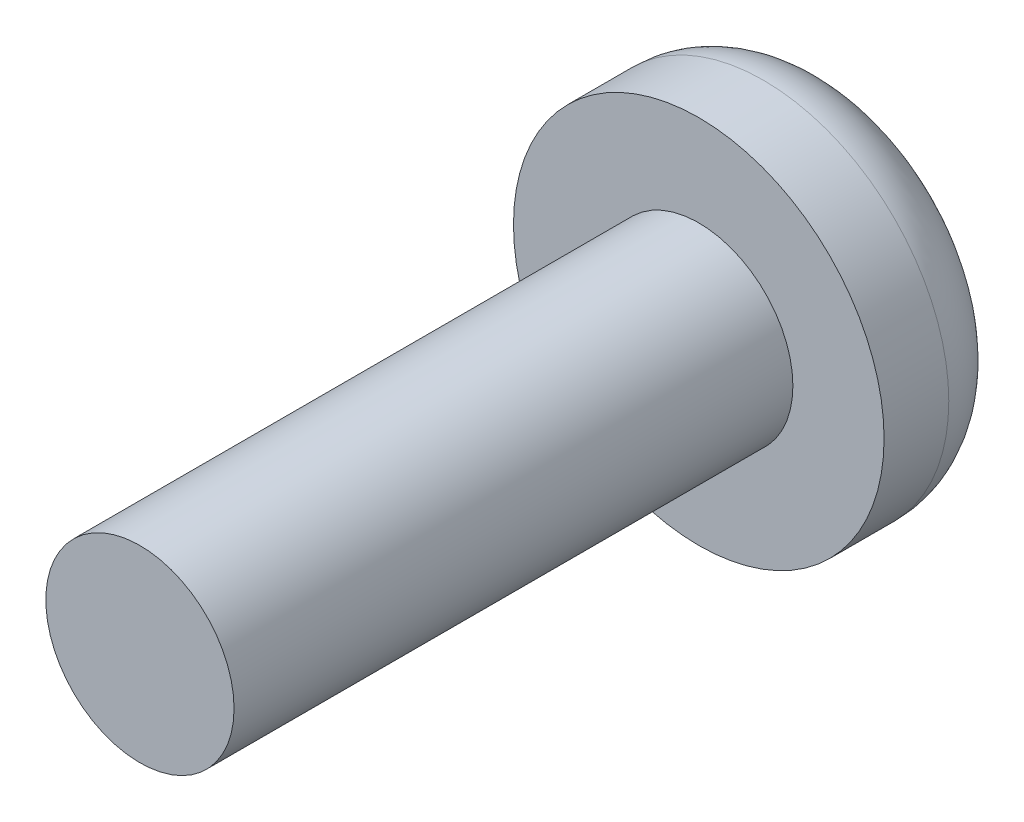
ISO-10303-21;
HEADER;
FILE_DESCRIPTION(('STEP AP214'),'2;1');
FILE_NAME('part.step','',(''),(''),'','','');
FILE_SCHEMA(('AUTOMOTIVE_DESIGN { 1 0 10303 214 1 1 1 1 }'));
ENDSEC;
DATA;
#1=APPLICATION_CONTEXT('core data for automotive mechanical design processes');
#2=APPLICATION_PROTOCOL_DEFINITION('international standard','automotive_design',2000,#1);
#3=PRODUCT_CONTEXT('',#1,'mechanical');
#4=PRODUCT('Part','Part','',(#3));
#5=PRODUCT_RELATED_PRODUCT_CATEGORY('part','',(#4));
#6=PRODUCT_DEFINITION_FORMATION('','',#4);
#7=PRODUCT_DEFINITION_CONTEXT('part definition',#1,'design');
#8=PRODUCT_DEFINITION('design','',#6,#7);
#9=PRODUCT_DEFINITION_SHAPE('','',#8);
#10=(LENGTH_UNIT() NAMED_UNIT(*) SI_UNIT(.MILLI.,.METRE.));
#11=(NAMED_UNIT(*) PLANE_ANGLE_UNIT() SI_UNIT($,.RADIAN.));
#12=(NAMED_UNIT(*) SI_UNIT($,.STERADIAN.) SOLID_ANGLE_UNIT());
#13=UNCERTAINTY_MEASURE_WITH_UNIT(LENGTH_MEASURE(1.E-05),#10,'distance_accuracy_value','');
#14=(GEOMETRIC_REPRESENTATION_CONTEXT(3) GLOBAL_UNCERTAINTY_ASSIGNED_CONTEXT((#13)) GLOBAL_UNIT_ASSIGNED_CONTEXT((#10,
#11,#12)) REPRESENTATION_CONTEXT('',''));
#15=CARTESIAN_POINT('',(0.,0.,0.));
#16=DIRECTION('',(0.,0.,1.));
#17=DIRECTION('',(1.,0.,0.));
#18=AXIS2_PLACEMENT_3D('',#15,#16,#17);
#19=CARTESIAN_POINT('',(0.,0.,0.));
#20=DIRECTION('',(0.,0.,1.));
#21=DIRECTION('',(1.,0.,0.));
#22=AXIS2_PLACEMENT_3D('',#19,#20,#21);
#23=PLANE('',#22);
#24=DIRECTION('',(1.,0.,0.));
#25=VECTOR('',#24,1.);
#26=CARTESIAN_POINT('',(-2.457284940462,0.307900911623638,0.));
#27=LINE('',#26,#25);
#28=CARTESIAN_POINT('',(0.307900911623639,0.307900911623638,0.));
#29=VERTEX_POINT('',#28);
#30=CARTESIAN_POINT('',(2.457284940462,0.307900911623638,0.));
#31=VERTEX_POINT('',#30);
#32=EDGE_CURVE('E202',#29,#31,#27,.T.);
#33=ORIENTED_EDGE('',*,*,#32,.F.);
#34=DIRECTION('',(0.,-1.,0.));
#35=VECTOR('',#34,1.);
#36=CARTESIAN_POINT('',(0.307900911623646,2.457284940462,0.));
#37=LINE('',#36,#35);
#38=CARTESIAN_POINT('',(0.307900911623646,2.457284940462,0.));
#39=VERTEX_POINT('',#38);
#40=EDGE_CURVE('E149',#39,#29,#37,.T.);
#41=ORIENTED_EDGE('',*,*,#40,.F.);
#42=CARTESIAN_POINT('',(0.,0.,0.));
#43=DIRECTION('',(0.,0.,1.));
#44=DIRECTION('',(1.,0.,0.));
#45=AXIS2_PLACEMENT_3D('',#42,#43,#44);
#46=CIRCLE('',#45,2.4765);
#47=EDGE_CURVE('E44',#39,#31,#46,.F.);
#48=ORIENTED_EDGE('',*,*,#47,.T.);
#49=EDGE_LOOP('',(#33,#41,#48));
#50=FACE_BOUND('',#49,.T.);
#51=ADVANCED_FACE('F35',(#50),#23,.F.);
#52=CARTESIAN_POINT('',(-0.307900911623629,2.457284940462,0.));
#53=VERTEX_POINT('',#52);
#54=EDGE_CURVE('E234',#53,#39,#46,.F.);
#55=ORIENTED_EDGE('',*,*,#54,.T.);
#56=DIRECTION('',(1.,0.,0.));
#57=VECTOR('',#56,1.);
#58=CARTESIAN_POINT('',(0.307900911623646,2.457284940462,0.));
#59=LINE('',#58,#57);
#60=EDGE_CURVE('E160',#53,#39,#59,.T.);
#61=ORIENTED_EDGE('',*,*,#60,.F.);
#62=EDGE_LOOP('',(#55,#61));
#63=FACE_BOUND('',#62,.T.);
#64=ADVANCED_FACE('F249',(#63),#23,.F.);
#65=CARTESIAN_POINT('',(2.457284940462,-0.307900911623636,0.));
#66=VERTEX_POINT('',#65);
#67=CARTESIAN_POINT('',(0.307900911623629,-2.457284940462,0.));
#68=VERTEX_POINT('',#67);
#69=EDGE_CURVE('E11',#66,#68,#46,.F.);
#70=ORIENTED_EDGE('',*,*,#69,.T.);
#71=CARTESIAN_POINT('',(0.307900911623636,-0.307900911623638,0.));
#72=VERTEX_POINT('',#71);
#73=EDGE_CURVE('E151',#72,#68,#37,.T.);
#74=ORIENTED_EDGE('',*,*,#73,.F.);
#75=DIRECTION('',(-1.,0.,0.));
#76=VECTOR('',#75,1.);
#77=CARTESIAN_POINT('',(-2.457284940462,-0.307900911623638,0.));
#78=LINE('',#77,#76);
#79=EDGE_CURVE('E196',#66,#72,#78,.T.);
#80=ORIENTED_EDGE('',*,*,#79,.F.);
#81=EDGE_LOOP('',(#70,#74,#80));
#82=FACE_BOUND('',#81,.T.);
#83=ADVANCED_FACE('F272',(#82),#23,.F.);
#84=CARTESIAN_POINT('',(-0.307900911623646,-2.457284940462,0.));
#85=VERTEX_POINT('',#84);
#86=EDGE_CURVE('E43',#68,#85,#46,.F.);
#87=ORIENTED_EDGE('',*,*,#86,.T.);
#88=DIRECTION('',(-1.,0.,0.));
#89=VECTOR('',#88,1.);
#90=CARTESIAN_POINT('',(0.307900911623629,-2.457284940462,0.));
#91=LINE('',#90,#89);
#92=EDGE_CURVE('E132',#68,#85,#91,.T.);
#93=ORIENTED_EDGE('',*,*,#92,.F.);
#94=EDGE_LOOP('',(#87,#93));
#95=FACE_BOUND('',#94,.T.);
#96=ADVANCED_FACE('F283',(#95),#23,.F.);
#97=CARTESIAN_POINT('',(-2.457284940462,0.307900911623638,1.016));
#98=DIRECTION('',(0.,1.,0.));
#99=DIRECTION('',(0.,0.,1.));
#100=AXIS2_PLACEMENT_3D('',#97,#98,#99);
#101=PLANE('',#100);
#102=DIRECTION('',(1.,0.,0.));
#103=VECTOR('',#102,1.);
#104=CARTESIAN_POINT('',(-2.457284940462,0.307900911623638,1.016));
#105=LINE('',#104,#103);
#106=CARTESIAN_POINT('',(0.307900911623638,0.307900911623638,1.016));
#107=VERTEX_POINT('',#106);
#108=CARTESIAN_POINT('',(2.457284940462,0.307900911623638,1.016));
#109=VERTEX_POINT('',#108);
#110=EDGE_CURVE('E190',#107,#109,#105,.T.);
#111=ORIENTED_EDGE('',*,*,#110,.F.);
#112=DIRECTION('',(0.,0.,-1.));
#113=VECTOR('',#112,1.);
#114=CARTESIAN_POINT('',(0.307900911623639,0.307900911623638,1.016));
#115=LINE('',#114,#113);
#116=EDGE_CURVE('E176',#107,#29,#115,.T.);
#117=ORIENTED_EDGE('',*,*,#116,.T.);
#118=ORIENTED_EDGE('',*,*,#32,.T.);
#119=DIRECTION('',(0.,0.,-1.));
#120=VECTOR('',#119,1.);
#121=CARTESIAN_POINT('',(2.457284940462,0.307900911623638,1.016));
#122=LINE('',#121,#120);
#123=EDGE_CURVE('E205',#109,#31,#122,.T.);
#124=ORIENTED_EDGE('',*,*,#123,.F.);
#125=EDGE_LOOP('',(#111,#117,#118,#124));
#126=FACE_BOUND('',#125,.T.);
#127=ADVANCED_FACE('F288',(#126),#101,.F.);
#128=CARTESIAN_POINT('',(-2.457284940462,-0.307900911623638,1.016));
#129=DIRECTION('',(0.,-1.,0.));
#130=DIRECTION('',(0.,0.,-1.));
#131=AXIS2_PLACEMENT_3D('',#128,#129,#130);
#132=PLANE('',#131);
#133=ORIENTED_EDGE('',*,*,#79,.T.);
#134=DIRECTION('',(0.,0.,1.));
#135=VECTOR('',#134,1.);
#136=CARTESIAN_POINT('',(0.307900911623637,-0.307900911623638,1.016));
#137=LINE('',#136,#135);
#138=CARTESIAN_POINT('',(0.307900911623636,-0.307900911623638,1.016));
#139=VERTEX_POINT('',#138);
#140=EDGE_CURVE('E173',#72,#139,#137,.T.);
#141=ORIENTED_EDGE('',*,*,#140,.T.);
#142=DIRECTION('',(-1.,0.,0.));
#143=VECTOR('',#142,1.);
#144=CARTESIAN_POINT('',(-2.457284940462,-0.307900911623638,1.016));
#145=LINE('',#144,#143);
#146=CARTESIAN_POINT('',(2.457284940462,-0.307900911623638,1.016));
#147=VERTEX_POINT('',#146);
#148=EDGE_CURVE('E185',#147,#139,#145,.T.);
#149=ORIENTED_EDGE('',*,*,#148,.F.);
#150=DIRECTION('',(0.,0.,-1.));
#151=VECTOR('',#150,1.);
#152=CARTESIAN_POINT('',(2.457284940462,-0.307900911623638,1.016));
#153=LINE('',#152,#151);
#154=EDGE_CURVE('E193',#147,#66,#153,.T.);
#155=ORIENTED_EDGE('',*,*,#154,.T.);
#156=EDGE_LOOP('',(#133,#141,#149,#155));
#157=FACE_BOUND('',#156,.T.);
#158=ADVANCED_FACE('F274',(#157),#132,.F.);
#159=EDGE_CURVE('E225',#31,#66,#46,.F.);
#160=ORIENTED_EDGE('',*,*,#159,.T.);
#161=DIRECTION('',(0.,-1.,0.));
#162=VECTOR('',#161,1.);
#163=CARTESIAN_POINT('',(2.457284940462,0.307900911623638,0.));
#164=LINE('',#163,#162);
#165=EDGE_CURVE('E179',#31,#66,#164,.T.);
#166=ORIENTED_EDGE('',*,*,#165,.F.);
#167=EDGE_LOOP('',(#160,#166));
#168=FACE_BOUND('',#167,.T.);
#169=ADVANCED_FACE('F280',(#168),#23,.F.);
#170=CARTESIAN_POINT('',(-2.457284940462,0.307900911623638,0.));
#171=VERTEX_POINT('',#170);
#172=EDGE_CURVE('E229',#171,#53,#46,.F.);
#173=ORIENTED_EDGE('',*,*,#172,.T.);
#174=DIRECTION('',(0.,1.,0.));
#175=VECTOR('',#174,1.);
#176=CARTESIAN_POINT('',(-0.307900911623629,2.457284940462,0.));
#177=LINE('',#176,#175);
#178=CARTESIAN_POINT('',(-0.307900911623636,0.307900911623638,0.));
#179=VERTEX_POINT('',#178);
#180=EDGE_CURVE('E157',#179,#53,#177,.T.);
#181=ORIENTED_EDGE('',*,*,#180,.F.);
#182=EDGE_CURVE('E184',#171,#179,#27,.T.);
#183=ORIENTED_EDGE('',*,*,#182,.F.);
#184=EDGE_LOOP('',(#173,#181,#183));
#185=FACE_BOUND('',#184,.T.);
#186=ADVANCED_FACE('F258',(#185),#23,.F.);
#187=CARTESIAN_POINT('',(-2.457284940462,-0.307900911623638,0.));
#188=VERTEX_POINT('',#187);
#189=EDGE_CURVE('E45',#188,#171,#46,.F.);
#190=ORIENTED_EDGE('',*,*,#189,.T.);
#191=DIRECTION('',(0.,1.,0.));
#192=VECTOR('',#191,1.);
#193=CARTESIAN_POINT('',(-2.457284940462,0.307900911623638,0.));
#194=LINE('',#193,#192);
#195=EDGE_CURVE('E199',#188,#171,#194,.T.);
#196=ORIENTED_EDGE('',*,*,#195,.F.);
#197=EDGE_LOOP('',(#190,#196));
#198=FACE_BOUND('',#197,.T.);
#199=ADVANCED_FACE('F268',(#198),#23,.F.);
#200=CARTESIAN_POINT('',(0.,0.,2.921));
#201=DIRECTION('',(0.,0.,1.));
#202=DIRECTION('',(1.,0.,0.));
#203=AXIS2_PLACEMENT_3D('',#200,#201,#202);
#204=PLANE('',#203);
#205=CARTESIAN_POINT('',(0.,0.,2.921));
#206=DIRECTION('',(0.,0.,1.));
#207=DIRECTION('',(1.,0.,0.));
#208=AXIS2_PLACEMENT_3D('',#205,#206,#207);
#209=CIRCLE('',#208,4.0005);
#210=CARTESIAN_POINT('',(4.0005,0.,2.921));
#211=VERTEX_POINT('',#210);
#212=EDGE_CURVE('E219',#211,#211,#209,.T.);
#213=ORIENTED_EDGE('',*,*,#212,.T.);
#214=EDGE_LOOP('',(#213));
#215=FACE_BOUND('',#214,.T.);
#216=CARTESIAN_POINT('',(0.,0.,2.921));
#217=DIRECTION('',(0.,0.,1.));
#218=DIRECTION('',(1.,0.,0.));
#219=AXIS2_PLACEMENT_3D('',#216,#217,#218);
#220=CIRCLE('',#219,2.032);
#221=CARTESIAN_POINT('',(2.032,0.,2.921));
#222=VERTEX_POINT('',#221);
#223=EDGE_CURVE('E208',#222,#222,#220,.T.);
#224=ORIENTED_EDGE('',*,*,#223,.F.);
#225=EDGE_LOOP('',(#224));
#226=FACE_BOUND('',#225,.T.);
#227=ADVANCED_FACE('F307',(#215,#226),#204,.T.);
#228=CARTESIAN_POINT('',(0.,0.,2.921));
#229=DIRECTION('',(0.,0.,-1.));
#230=DIRECTION('',(-1.,0.,0.));
#231=AXIS2_PLACEMENT_3D('',#228,#229,#230);
#232=CYLINDRICAL_SURFACE('',#231,4.0005);
#233=CARTESIAN_POINT('',(0.,0.,1.524));
#234=DIRECTION('',(0.,0.,1.));
#235=DIRECTION('',(1.,0.,0.));
#236=AXIS2_PLACEMENT_3D('',#233,#234,#235);
#237=CIRCLE('',#236,4.0005);
#238=CARTESIAN_POINT('',(4.0005,0.,1.524));
#239=VERTEX_POINT('',#238);
#240=EDGE_CURVE('E223',#239,#239,#237,.T.);
#241=ORIENTED_EDGE('',*,*,#240,.T.);
#242=EDGE_LOOP('',(#241));
#243=FACE_BOUND('',#242,.T.);
#244=ORIENTED_EDGE('',*,*,#212,.F.);
#245=EDGE_LOOP('',(#244));
#246=FACE_BOUND('',#245,.T.);
#247=ADVANCED_FACE('F301',(#243,#246),#232,.T.);
#248=CARTESIAN_POINT('',(-0.307900911623639,-0.307900911623638,0.));
#249=VERTEX_POINT('',#248);
#250=EDGE_CURVE('E195',#249,#188,#78,.T.);
#251=ORIENTED_EDGE('',*,*,#250,.F.);
#252=EDGE_CURVE('E158',#85,#249,#177,.T.);
#253=ORIENTED_EDGE('',*,*,#252,.F.);
#254=EDGE_CURVE('E237',#85,#188,#46,.F.);
#255=ORIENTED_EDGE('',*,*,#254,.T.);
#256=EDGE_LOOP('',(#251,#253,#255));
#257=FACE_BOUND('',#256,.T.);
#258=ADVANCED_FACE('F291',(#257),#23,.F.);
#259=CARTESIAN_POINT('',(0.,0.,1.524));
#260=DIRECTION('',(0.,0.,1.));
#261=DIRECTION('',(1.,0.,0.));
#262=AXIS2_PLACEMENT_3D('',#259,#260,#261);
#263=TOROIDAL_SURFACE('',#262,2.4765,1.524);
#264=ORIENTED_EDGE('',*,*,#69,.F.);
#265=ORIENTED_EDGE('',*,*,#159,.F.);
#266=ORIENTED_EDGE('',*,*,#47,.F.);
#267=ORIENTED_EDGE('',*,*,#54,.F.);
#268=ORIENTED_EDGE('',*,*,#172,.F.);
#269=ORIENTED_EDGE('',*,*,#189,.F.);
#270=ORIENTED_EDGE('',*,*,#254,.F.);
#271=ORIENTED_EDGE('',*,*,#86,.F.);
#272=EDGE_LOOP('',(#264,#265,#266,#267,#268,#269,#270,#271));
#273=FACE_BOUND('',#272,.T.);
#274=ORIENTED_EDGE('',*,*,#240,.F.);
#275=EDGE_LOOP('',(#274));
#276=FACE_BOUND('',#275,.T.);
#277=ADVANCED_FACE('F37',(#273,#276),#263,.T.);
#278=CARTESIAN_POINT('',(0.,0.,14.986));
#279=DIRECTION('',(0.,0.,-1.));
#280=DIRECTION('',(-1.,0.,0.));
#281=AXIS2_PLACEMENT_3D('',#278,#279,#280);
#282=CYLINDRICAL_SURFACE('',#281,2.032);
#283=CARTESIAN_POINT('',(0.,0.,14.986));
#284=DIRECTION('',(0.,0.,1.));
#285=DIRECTION('',(1.,0.,0.));
#286=AXIS2_PLACEMENT_3D('',#283,#284,#285);
#287=CIRCLE('',#286,2.032);
#288=CARTESIAN_POINT('',(2.032,0.,14.986));
#289=VERTEX_POINT('',#288);
#290=EDGE_CURVE('E216',#289,#289,#287,.T.);
#291=ORIENTED_EDGE('',*,*,#290,.F.);
#292=EDGE_LOOP('',(#291));
#293=FACE_BOUND('',#292,.T.);
#294=ORIENTED_EDGE('',*,*,#223,.T.);
#295=EDGE_LOOP('',(#294));
#296=FACE_BOUND('',#295,.T.);
#297=ADVANCED_FACE('F306',(#293,#296),#282,.T.);
#298=CARTESIAN_POINT('',(0.,0.,14.986));
#299=DIRECTION('',(0.,0.,1.));
#300=DIRECTION('',(1.,0.,0.));
#301=AXIS2_PLACEMENT_3D('',#298,#299,#300);
#302=PLANE('',#301);
#303=ORIENTED_EDGE('',*,*,#290,.T.);
#304=EDGE_LOOP('',(#303));
#305=FACE_BOUND('',#304,.T.);
#306=ADVANCED_FACE('F319',(#305),#302,.T.);
#307=CARTESIAN_POINT('',(2.457284940462,0.307900911623638,1.016));
#308=DIRECTION('',(1.,0.,0.));
#309=DIRECTION('',(0.,0.,-1.));
#310=AXIS2_PLACEMENT_3D('',#307,#308,#309);
#311=PLANE('',#310);
#312=ORIENTED_EDGE('',*,*,#165,.T.);
#313=ORIENTED_EDGE('',*,*,#154,.F.);
#314=DIRECTION('',(0.,-1.,0.));
#315=VECTOR('',#314,1.);
#316=CARTESIAN_POINT('',(2.457284940462,0.307900911623638,1.016));
#317=LINE('',#316,#315);
#318=EDGE_CURVE('E180',#109,#147,#317,.T.);
#319=ORIENTED_EDGE('',*,*,#318,.F.);
#320=ORIENTED_EDGE('',*,*,#123,.T.);
#321=EDGE_LOOP('',(#312,#313,#319,#320));
#322=FACE_BOUND('',#321,.T.);
#323=ADVANCED_FACE('F278',(#322),#311,.F.);
#324=ORIENTED_EDGE('',*,*,#182,.T.);
#325=DIRECTION('',(0.,0.,1.));
#326=VECTOR('',#325,1.);
#327=CARTESIAN_POINT('',(-0.307900911623636,0.307900911623638,1.016));
#328=LINE('',#327,#326);
#329=CARTESIAN_POINT('',(-0.307900911623636,0.307900911623638,1.016));
#330=VERTEX_POINT('',#329);
#331=EDGE_CURVE('E170',#179,#330,#328,.T.);
#332=ORIENTED_EDGE('',*,*,#331,.T.);
#333=CARTESIAN_POINT('',(-2.457284940462,0.307900911623638,1.016));
#334=VERTEX_POINT('',#333);
#335=EDGE_CURVE('E191',#334,#330,#105,.T.);
#336=ORIENTED_EDGE('',*,*,#335,.F.);
#337=DIRECTION('',(0.,0.,-1.));
#338=VECTOR('',#337,1.);
#339=CARTESIAN_POINT('',(-2.457284940462,0.307900911623638,1.016));
#340=LINE('',#339,#338);
#341=EDGE_CURVE('E209',#334,#171,#340,.T.);
#342=ORIENTED_EDGE('',*,*,#341,.T.);
#343=EDGE_LOOP('',(#324,#332,#336,#342));
#344=FACE_BOUND('',#343,.T.);
#345=ADVANCED_FACE('F260',(#344),#101,.F.);
#346=CARTESIAN_POINT('',(-2.457284940462,0.307900911623638,1.016));
#347=DIRECTION('',(-1.,0.,0.));
#348=DIRECTION('',(0.,0.,1.));
#349=AXIS2_PLACEMENT_3D('',#346,#347,#348);
#350=PLANE('',#349);
#351=ORIENTED_EDGE('',*,*,#195,.T.);
#352=ORIENTED_EDGE('',*,*,#341,.F.);
#353=DIRECTION('',(0.,1.,0.));
#354=VECTOR('',#353,1.);
#355=CARTESIAN_POINT('',(-2.457284940462,0.307900911623638,1.016));
#356=LINE('',#355,#354);
#357=CARTESIAN_POINT('',(-2.457284940462,-0.307900911623638,1.016));
#358=VERTEX_POINT('',#357);
#359=EDGE_CURVE('E187',#358,#334,#356,.T.);
#360=ORIENTED_EDGE('',*,*,#359,.F.);
#361=DIRECTION('',(0.,0.,-1.));
#362=VECTOR('',#361,1.);
#363=CARTESIAN_POINT('',(-2.457284940462,-0.307900911623638,1.016));
#364=LINE('',#363,#362);
#365=EDGE_CURVE('E211',#358,#188,#364,.T.);
#366=ORIENTED_EDGE('',*,*,#365,.T.);
#367=EDGE_LOOP('',(#351,#352,#360,#366));
#368=FACE_BOUND('',#367,.T.);
#369=ADVANCED_FACE('F265',(#368),#350,.F.);
#370=CARTESIAN_POINT('',(-0.307900911623637,-0.307900911623638,1.016));
#371=VERTEX_POINT('',#370);
#372=EDGE_CURVE('E183',#371,#358,#145,.T.);
#373=ORIENTED_EDGE('',*,*,#372,.F.);
#374=DIRECTION('',(0.,0.,-1.));
#375=VECTOR('',#374,1.);
#376=CARTESIAN_POINT('',(-0.307900911623638,-0.307900911623638,1.016));
#377=LINE('',#376,#375);
#378=EDGE_CURVE('E139',#371,#249,#377,.T.);
#379=ORIENTED_EDGE('',*,*,#378,.T.);
#380=ORIENTED_EDGE('',*,*,#250,.T.);
#381=ORIENTED_EDGE('',*,*,#365,.F.);
#382=EDGE_LOOP('',(#373,#379,#380,#381));
#383=FACE_BOUND('',#382,.T.);
#384=ADVANCED_FACE('F290',(#383),#132,.F.);
#385=CARTESIAN_POINT('',(2.457284940462,-0.307900911623638,1.016));
#386=DIRECTION('',(0.,0.,1.));
#387=DIRECTION('',(1.,0.,0.));
#388=AXIS2_PLACEMENT_3D('',#385,#386,#387);
#389=PLANE('',#388);
#390=ORIENTED_EDGE('',*,*,#335,.T.);
#391=DIRECTION('',(0.,1.,0.));
#392=VECTOR('',#391,1.);
#393=CARTESIAN_POINT('',(-0.307900911623629,2.457284940462,1.016));
#394=LINE('',#393,#392);
#395=CARTESIAN_POINT('',(-0.307900911623629,2.457284940462,1.016));
#396=VERTEX_POINT('',#395);
#397=EDGE_CURVE('E142',#330,#396,#394,.T.);
#398=ORIENTED_EDGE('',*,*,#397,.T.);
#399=DIRECTION('',(1.,0.,0.));
#400=VECTOR('',#399,1.);
#401=CARTESIAN_POINT('',(0.307900911623646,2.457284940462,1.016));
#402=LINE('',#401,#400);
#403=CARTESIAN_POINT('',(0.307900911623646,2.457284940462,1.016));
#404=VERTEX_POINT('',#403);
#405=EDGE_CURVE('E141',#396,#404,#402,.T.);
#406=ORIENTED_EDGE('',*,*,#405,.T.);
#407=DIRECTION('',(0.,-1.,0.));
#408=VECTOR('',#407,1.);
#409=CARTESIAN_POINT('',(0.307900911623646,2.457284940462,1.016));
#410=LINE('',#409,#408);
#411=EDGE_CURVE('E52',#404,#107,#410,.T.);
#412=ORIENTED_EDGE('',*,*,#411,.T.);
#413=ORIENTED_EDGE('',*,*,#110,.T.);
#414=ORIENTED_EDGE('',*,*,#318,.T.);
#415=ORIENTED_EDGE('',*,*,#148,.T.);
#416=CARTESIAN_POINT('',(0.307900911623629,-2.457284940462,1.016));
#417=VERTEX_POINT('',#416);
#418=EDGE_CURVE('E147',#139,#417,#410,.T.);
#419=ORIENTED_EDGE('',*,*,#418,.T.);
#420=DIRECTION('',(-1.,0.,0.));
#421=VECTOR('',#420,1.);
#422=CARTESIAN_POINT('',(0.307900911623629,-2.457284940462,1.016));
#423=LINE('',#422,#421);
#424=CARTESIAN_POINT('',(-0.307900911623646,-2.457284940462,1.016));
#425=VERTEX_POINT('',#424);
#426=EDGE_CURVE('E130',#417,#425,#423,.T.);
#427=ORIENTED_EDGE('',*,*,#426,.T.);
#428=EDGE_CURVE('E59',#425,#371,#394,.T.);
#429=ORIENTED_EDGE('',*,*,#428,.T.);
#430=ORIENTED_EDGE('',*,*,#372,.T.);
#431=ORIENTED_EDGE('',*,*,#359,.T.);
#432=EDGE_LOOP('',(#390,#398,#406,#412,#413,#414,#415,#419,#427,#429,#430,#431));
#433=FACE_BOUND('',#432,.T.);
#434=ADVANCED_FACE('F145',(#433),#389,.F.);
#435=CARTESIAN_POINT('',(-0.307900911623629,2.457284940462,1.016));
#436=DIRECTION('',(-1.,0.,0.));
#437=DIRECTION('',(0.,-1.,0.));
#438=AXIS2_PLACEMENT_3D('',#435,#436,#437);
#439=PLANE('',#438);
#440=ORIENTED_EDGE('',*,*,#428,.F.);
#441=DIRECTION('',(0.,0.,-1.));
#442=VECTOR('',#441,1.);
#443=CARTESIAN_POINT('',(-0.307900911623646,-2.457284940462,1.016));
#444=LINE('',#443,#442);
#445=EDGE_CURVE('E127',#425,#85,#444,.T.);
#446=ORIENTED_EDGE('',*,*,#445,.T.);
#447=ORIENTED_EDGE('',*,*,#252,.T.);
#448=ORIENTED_EDGE('',*,*,#378,.F.);
#449=EDGE_LOOP('',(#440,#446,#447,#448));
#450=FACE_BOUND('',#449,.T.);
#451=ADVANCED_FACE('F137',(#450),#439,.F.);
#452=CARTESIAN_POINT('',(0.307900911623646,2.457284940462,1.016));
#453=DIRECTION('',(1.,0.,0.));
#454=DIRECTION('',(0.,1.,0.));
#455=AXIS2_PLACEMENT_3D('',#452,#453,#454);
#456=PLANE('',#455);
#457=ORIENTED_EDGE('',*,*,#73,.T.);
#458=DIRECTION('',(0.,0.,-1.));
#459=VECTOR('',#458,1.);
#460=CARTESIAN_POINT('',(0.307900911623629,-2.457284940462,1.016));
#461=LINE('',#460,#459);
#462=EDGE_CURVE('E163',#417,#68,#461,.T.);
#463=ORIENTED_EDGE('',*,*,#462,.F.);
#464=ORIENTED_EDGE('',*,*,#418,.F.);
#465=ORIENTED_EDGE('',*,*,#140,.F.);
#466=EDGE_LOOP('',(#457,#463,#464,#465));
#467=FACE_BOUND('',#466,.T.);
#468=ADVANCED_FACE('F337',(#467),#456,.F.);
#469=CARTESIAN_POINT('',(0.307900911623629,-2.457284940462,1.016));
#470=DIRECTION('',(0.,-1.,0.));
#471=DIRECTION('',(1.,0.,0.));
#472=AXIS2_PLACEMENT_3D('',#469,#470,#471);
#473=PLANE('',#472);
#474=ORIENTED_EDGE('',*,*,#92,.T.);
#475=ORIENTED_EDGE('',*,*,#445,.F.);
#476=ORIENTED_EDGE('',*,*,#426,.F.);
#477=ORIENTED_EDGE('',*,*,#462,.T.);
#478=EDGE_LOOP('',(#474,#475,#476,#477));
#479=FACE_BOUND('',#478,.T.);
#480=ADVANCED_FACE('F128',(#479),#473,.F.);
#481=ORIENTED_EDGE('',*,*,#411,.F.);
#482=DIRECTION('',(0.,0.,-1.));
#483=VECTOR('',#482,1.);
#484=CARTESIAN_POINT('',(0.307900911623646,2.457284940462,1.016));
#485=LINE('',#484,#483);
#486=EDGE_CURVE('E165',#404,#39,#485,.T.);
#487=ORIENTED_EDGE('',*,*,#486,.T.);
#488=ORIENTED_EDGE('',*,*,#40,.T.);
#489=ORIENTED_EDGE('',*,*,#116,.F.);
#490=EDGE_LOOP('',(#481,#487,#488,#489));
#491=FACE_BOUND('',#490,.T.);
#492=ADVANCED_FACE('F336',(#491),#456,.F.);
#493=ORIENTED_EDGE('',*,*,#180,.T.);
#494=DIRECTION('',(0.,0.,-1.));
#495=VECTOR('',#494,1.);
#496=CARTESIAN_POINT('',(-0.307900911623629,2.457284940462,1.016));
#497=LINE('',#496,#495);
#498=EDGE_CURVE('E135',#396,#53,#497,.T.);
#499=ORIENTED_EDGE('',*,*,#498,.F.);
#500=ORIENTED_EDGE('',*,*,#397,.F.);
#501=ORIENTED_EDGE('',*,*,#331,.F.);
#502=EDGE_LOOP('',(#493,#499,#500,#501));
#503=FACE_BOUND('',#502,.T.);
#504=ADVANCED_FACE('F338',(#503),#439,.F.);
#505=CARTESIAN_POINT('',(0.307900911623646,2.457284940462,1.016));
#506=DIRECTION('',(0.,1.,0.));
#507=DIRECTION('',(-1.,0.,0.));
#508=AXIS2_PLACEMENT_3D('',#505,#506,#507);
#509=PLANE('',#508);
#510=ORIENTED_EDGE('',*,*,#60,.T.);
#511=ORIENTED_EDGE('',*,*,#486,.F.);
#512=ORIENTED_EDGE('',*,*,#405,.F.);
#513=ORIENTED_EDGE('',*,*,#498,.T.);
#514=EDGE_LOOP('',(#510,#511,#512,#513));
#515=FACE_BOUND('',#514,.T.);
#516=ADVANCED_FACE('F341',(#515),#509,.F.);
#517=CLOSED_SHELL('',(#51,#64,#83,#96,#127,#158,#169,#186,#199,#227,#247,#258,#277,#297,#306,
#323,#345,#369,#384,#434,#451,#468,#480,#492,#504,#516));
#518=MANIFOLD_SOLID_BREP('B2',#517);
#519=ADVANCED_BREP_SHAPE_REPRESENTATION('',(#18,#518),#14);
#520=SHAPE_DEFINITION_REPRESENTATION(#9,#519);
ENDSEC;
END-ISO-10303-21;
